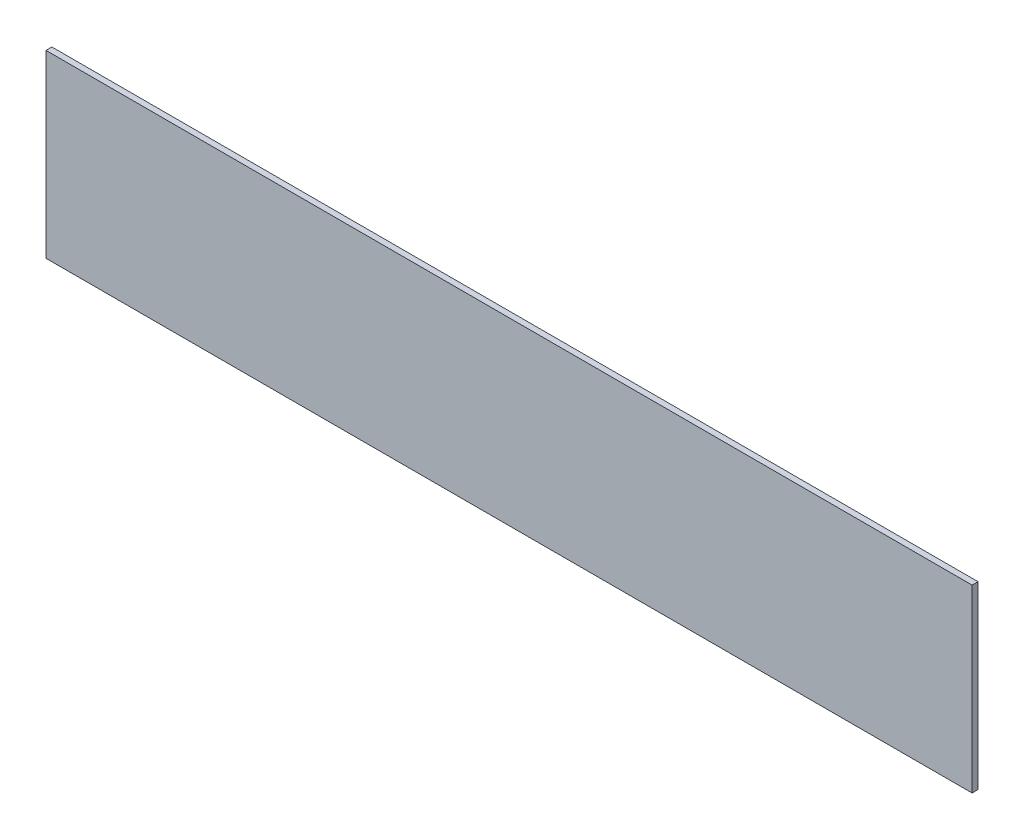
ISO-10303-21;
HEADER;
FILE_DESCRIPTION(('STEP AP214'),'2;1');
FILE_NAME('part.step','',(''),(''),'','','');
FILE_SCHEMA(('AUTOMOTIVE_DESIGN { 1 0 10303 214 1 1 1 1 }'));
ENDSEC;
DATA;
#1=APPLICATION_CONTEXT('core data for automotive mechanical design processes');
#2=APPLICATION_PROTOCOL_DEFINITION('international standard','automotive_design',2000,#1);
#3=PRODUCT_CONTEXT('',#1,'mechanical');
#4=PRODUCT('Part','Part','',(#3));
#5=PRODUCT_RELATED_PRODUCT_CATEGORY('part','',(#4));
#6=PRODUCT_DEFINITION_FORMATION('','',#4);
#7=PRODUCT_DEFINITION_CONTEXT('part definition',#1,'design');
#8=PRODUCT_DEFINITION('design','',#6,#7);
#9=PRODUCT_DEFINITION_SHAPE('','',#8);
#10=(LENGTH_UNIT() NAMED_UNIT(*) SI_UNIT(.MILLI.,.METRE.));
#11=(NAMED_UNIT(*) PLANE_ANGLE_UNIT() SI_UNIT($,.RADIAN.));
#12=(NAMED_UNIT(*) SI_UNIT($,.STERADIAN.) SOLID_ANGLE_UNIT());
#13=UNCERTAINTY_MEASURE_WITH_UNIT(LENGTH_MEASURE(1.E-05),#10,'distance_accuracy_value','');
#14=(GEOMETRIC_REPRESENTATION_CONTEXT(3) GLOBAL_UNCERTAINTY_ASSIGNED_CONTEXT((#13)) GLOBAL_UNIT_ASSIGNED_CONTEXT((#10,
#11,#12)) REPRESENTATION_CONTEXT('',''));
#15=CARTESIAN_POINT('',(0.,0.,0.));
#16=DIRECTION('',(0.,0.,1.));
#17=DIRECTION('',(1.,0.,0.));
#18=AXIS2_PLACEMENT_3D('',#15,#16,#17);
#19=CARTESIAN_POINT('',(0.,0.,0.));
#20=DIRECTION('',(0.,0.,-1.));
#21=DIRECTION('',(-1.,0.,0.));
#22=AXIS2_PLACEMENT_3D('',#19,#20,#21);
#23=PLANE('',#22);
#24=DIRECTION('',(0.,-1.,0.));
#25=VECTOR('',#24,1.);
#26=CARTESIAN_POINT('',(-228.6,-571.993937924995,0.));
#27=LINE('',#26,#25);
#28=CARTESIAN_POINT('',(-228.6,-483.093937924995,0.));
#29=VERTEX_POINT('',#28);
#30=CARTESIAN_POINT('',(-228.6,-571.993937924995,0.));
#31=VERTEX_POINT('',#30);
#32=EDGE_CURVE('E78',#29,#31,#27,.T.);
#33=ORIENTED_EDGE('',*,*,#32,.F.);
#34=DIRECTION('',(-1.,0.,0.));
#35=VECTOR('',#34,1.);
#36=CARTESIAN_POINT('',(-228.6,-483.093937924995,0.));
#37=LINE('',#36,#35);
#38=CARTESIAN_POINT('',(228.6,-483.093937924995,0.));
#39=VERTEX_POINT('',#38);
#40=EDGE_CURVE('E89',#39,#29,#37,.T.);
#41=ORIENTED_EDGE('',*,*,#40,.F.);
#42=DIRECTION('',(0.,1.,0.));
#43=VECTOR('',#42,1.);
#44=CARTESIAN_POINT('',(228.6,-571.993937924995,0.));
#45=LINE('',#44,#43);
#46=CARTESIAN_POINT('',(228.6,-571.993937924995,0.));
#47=VERTEX_POINT('',#46);
#48=EDGE_CURVE('E80',#47,#39,#45,.T.);
#49=ORIENTED_EDGE('',*,*,#48,.F.);
#50=DIRECTION('',(1.,0.,0.));
#51=VECTOR('',#50,1.);
#52=CARTESIAN_POINT('',(-228.6,-571.993937924995,0.));
#53=LINE('',#52,#51);
#54=EDGE_CURVE('E70',#31,#47,#53,.T.);
#55=ORIENTED_EDGE('',*,*,#54,.F.);
#56=EDGE_LOOP('',(#33,#41,#49,#55));
#57=FACE_BOUND('',#56,.T.);
#58=ADVANCED_FACE('F28',(#57),#23,.T.);
#59=CARTESIAN_POINT('',(-228.6,-483.093937924995,468.683868850663));
#60=DIRECTION('',(0.,-1.,0.));
#61=DIRECTION('',(0.,0.,-1.));
#62=AXIS2_PLACEMENT_3D('',#59,#60,#61);
#63=PLANE('',#62);
#64=DIRECTION('',(0.,0.,-1.));
#65=VECTOR('',#64,1.);
#66=CARTESIAN_POINT('',(-228.6,-483.093937924995,468.683868850663));
#67=LINE('',#66,#65);
#68=CARTESIAN_POINT('',(-228.6,-483.093937924995,2.92100000000001));
#69=VERTEX_POINT('',#68);
#70=EDGE_CURVE('E83',#69,#29,#67,.T.);
#71=ORIENTED_EDGE('',*,*,#70,.F.);
#72=DIRECTION('',(1.,0.,0.));
#73=VECTOR('',#72,1.);
#74=CARTESIAN_POINT('',(-228.6,-483.093937924995,2.92100000000001));
#75=LINE('',#74,#73);
#76=CARTESIAN_POINT('',(228.6,-483.093937924995,2.92100000000001));
#77=VERTEX_POINT('',#76);
#78=EDGE_CURVE('E32',#69,#77,#75,.T.);
#79=ORIENTED_EDGE('',*,*,#78,.T.);
#80=DIRECTION('',(0.,0.,-1.));
#81=VECTOR('',#80,1.);
#82=CARTESIAN_POINT('',(228.6,-483.093937924995,468.683868850663));
#83=LINE('',#82,#81);
#84=EDGE_CURVE('E92',#77,#39,#83,.T.);
#85=ORIENTED_EDGE('',*,*,#84,.T.);
#86=ORIENTED_EDGE('',*,*,#40,.T.);
#87=EDGE_LOOP('',(#71,#79,#85,#86));
#88=FACE_BOUND('',#87,.T.);
#89=ADVANCED_FACE('F101',(#88),#63,.F.);
#90=CARTESIAN_POINT('',(228.6,-571.993937924995,468.683868850663));
#91=DIRECTION('',(-1.,0.,0.));
#92=DIRECTION('',(0.,0.,1.));
#93=AXIS2_PLACEMENT_3D('',#90,#91,#92);
#94=PLANE('',#93);
#95=ORIENTED_EDGE('',*,*,#84,.F.);
#96=DIRECTION('',(0.,-1.,0.));
#97=VECTOR('',#96,1.);
#98=CARTESIAN_POINT('',(228.6,-571.993937924995,2.92100000000001));
#99=LINE('',#98,#97);
#100=CARTESIAN_POINT('',(228.6,-571.993937924995,2.92100000000001));
#101=VERTEX_POINT('',#100);
#102=EDGE_CURVE('E98',#77,#101,#99,.T.);
#103=ORIENTED_EDGE('',*,*,#102,.T.);
#104=DIRECTION('',(0.,0.,-1.));
#105=VECTOR('',#104,1.);
#106=CARTESIAN_POINT('',(228.6,-571.993937924995,468.683868850663));
#107=LINE('',#106,#105);
#108=EDGE_CURVE('E74',#101,#47,#107,.T.);
#109=ORIENTED_EDGE('',*,*,#108,.T.);
#110=ORIENTED_EDGE('',*,*,#48,.T.);
#111=EDGE_LOOP('',(#95,#103,#109,#110));
#112=FACE_BOUND('',#111,.T.);
#113=ADVANCED_FACE('F97',(#112),#94,.F.);
#114=CARTESIAN_POINT('',(-228.6,-571.993937924995,468.683868850663));
#115=DIRECTION('',(0.,1.,0.));
#116=DIRECTION('',(0.,0.,1.));
#117=AXIS2_PLACEMENT_3D('',#114,#115,#116);
#118=PLANE('',#117);
#119=ORIENTED_EDGE('',*,*,#108,.F.);
#120=DIRECTION('',(-1.,0.,0.));
#121=VECTOR('',#120,1.);
#122=CARTESIAN_POINT('',(-228.6,-571.993937924995,2.92100000000001));
#123=LINE('',#122,#121);
#124=CARTESIAN_POINT('',(-228.6,-571.993937924995,2.92100000000001));
#125=VERTEX_POINT('',#124);
#126=EDGE_CURVE('E37',#101,#125,#123,.T.);
#127=ORIENTED_EDGE('',*,*,#126,.T.);
#128=DIRECTION('',(0.,0.,-1.));
#129=VECTOR('',#128,1.);
#130=CARTESIAN_POINT('',(-228.6,-571.993937924995,468.683868850663));
#131=LINE('',#130,#129);
#132=EDGE_CURVE('E67',#125,#31,#131,.T.);
#133=ORIENTED_EDGE('',*,*,#132,.T.);
#134=ORIENTED_EDGE('',*,*,#54,.T.);
#135=EDGE_LOOP('',(#119,#127,#133,#134));
#136=FACE_BOUND('',#135,.T.);
#137=ADVANCED_FACE('F69',(#136),#118,.F.);
#138=CARTESIAN_POINT('',(-228.6,-571.993937924995,468.683868850663));
#139=DIRECTION('',(1.,0.,0.));
#140=DIRECTION('',(0.,0.,-1.));
#141=AXIS2_PLACEMENT_3D('',#138,#139,#140);
#142=PLANE('',#141);
#143=ORIENTED_EDGE('',*,*,#132,.F.);
#144=DIRECTION('',(0.,1.,0.));
#145=VECTOR('',#144,1.);
#146=CARTESIAN_POINT('',(-228.6,-571.993937924995,2.92100000000001));
#147=LINE('',#146,#145);
#148=EDGE_CURVE('E11',#125,#69,#147,.T.);
#149=ORIENTED_EDGE('',*,*,#148,.T.);
#150=ORIENTED_EDGE('',*,*,#70,.T.);
#151=ORIENTED_EDGE('',*,*,#32,.T.);
#152=EDGE_LOOP('',(#143,#149,#150,#151));
#153=FACE_BOUND('',#152,.T.);
#154=ADVANCED_FACE('F30',(#153),#142,.F.);
#155=CARTESIAN_POINT('',(0.,0.,2.92099999999999));
#156=DIRECTION('',(0.,0.,-1.));
#157=DIRECTION('',(0.,1.,0.));
#158=AXIS2_PLACEMENT_3D('',#155,#156,#157);
#159=PLANE('',#158);
#160=ORIENTED_EDGE('',*,*,#126,.F.);
#161=ORIENTED_EDGE('',*,*,#102,.F.);
#162=ORIENTED_EDGE('',*,*,#78,.F.);
#163=ORIENTED_EDGE('',*,*,#148,.F.);
#164=EDGE_LOOP('',(#160,#161,#162,#163));
#165=FACE_BOUND('',#164,.T.);
#166=ADVANCED_FACE('F115',(#165),#159,.F.);
#167=CLOSED_SHELL('',(#58,#89,#113,#137,#154,#166));
#168=MANIFOLD_SOLID_BREP('B2',#167);
#169=ADVANCED_BREP_SHAPE_REPRESENTATION('',(#18,#168),#14);
#170=SHAPE_DEFINITION_REPRESENTATION(#9,#169);
ENDSEC;
END-ISO-10303-21;
